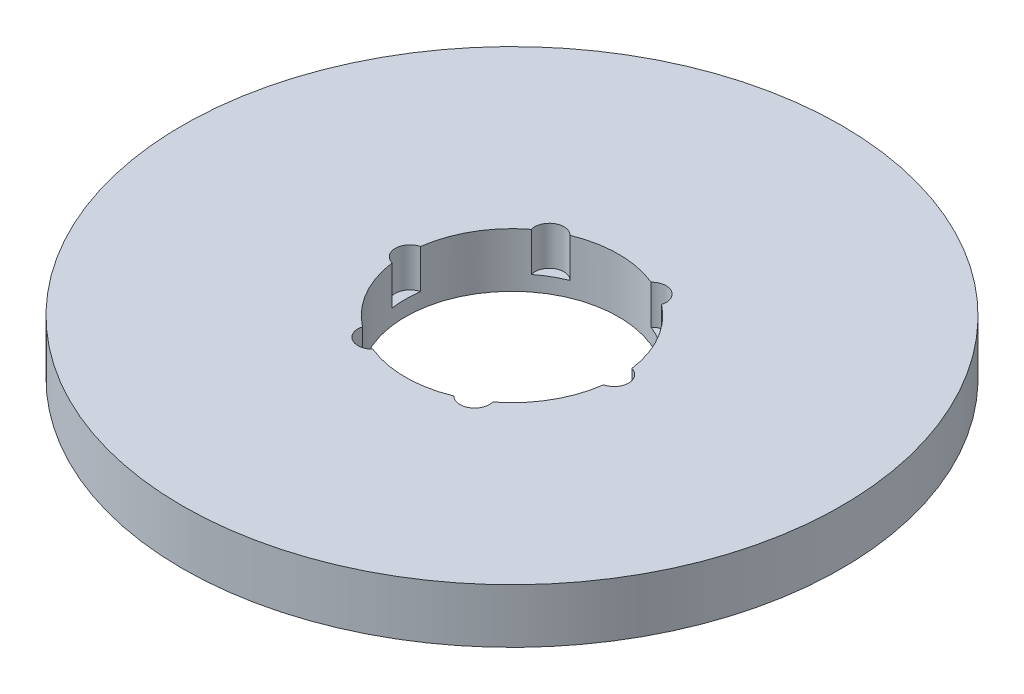
ISO-10303-21;
HEADER;
FILE_DESCRIPTION(('STEP AP214'),'2;1');
FILE_NAME('part.step','',(''),(''),'','','');
FILE_SCHEMA(('AUTOMOTIVE_DESIGN { 1 0 10303 214 1 1 1 1 }'));
ENDSEC;
DATA;
#1=APPLICATION_CONTEXT('core data for automotive mechanical design processes');
#2=APPLICATION_PROTOCOL_DEFINITION('international standard','automotive_design',2000,#1);
#3=PRODUCT_CONTEXT('',#1,'mechanical');
#4=PRODUCT('Part','Part','',(#3));
#5=PRODUCT_RELATED_PRODUCT_CATEGORY('part','',(#4));
#6=PRODUCT_DEFINITION_FORMATION('','',#4);
#7=PRODUCT_DEFINITION_CONTEXT('part definition',#1,'design');
#8=PRODUCT_DEFINITION('design','',#6,#7);
#9=PRODUCT_DEFINITION_SHAPE('','',#8);
#10=(LENGTH_UNIT() NAMED_UNIT(*) SI_UNIT(.MILLI.,.METRE.));
#11=(NAMED_UNIT(*) PLANE_ANGLE_UNIT() SI_UNIT($,.RADIAN.));
#12=(NAMED_UNIT(*) SI_UNIT($,.STERADIAN.) SOLID_ANGLE_UNIT());
#13=UNCERTAINTY_MEASURE_WITH_UNIT(LENGTH_MEASURE(1.E-05),#10,'distance_accuracy_value','');
#14=(GEOMETRIC_REPRESENTATION_CONTEXT(3) GLOBAL_UNCERTAINTY_ASSIGNED_CONTEXT((#13)) GLOBAL_UNIT_ASSIGNED_CONTEXT((#10,
#11,#12)) REPRESENTATION_CONTEXT('',''));
#15=CARTESIAN_POINT('',(0.,0.,0.));
#16=DIRECTION('',(0.,0.,1.));
#17=DIRECTION('',(1.,0.,0.));
#18=AXIS2_PLACEMENT_3D('',#15,#16,#17);
#19=CARTESIAN_POINT('',(0.,14.,0.));
#20=DIRECTION('',(0.,-1.,0.));
#21=DIRECTION('',(0.,0.,-1.));
#22=AXIS2_PLACEMENT_3D('',#19,#20,#21);
#23=CYLINDRICAL_SURFACE('',#22,85.);
#24=CARTESIAN_POINT('',(0.,14.,0.));
#25=DIRECTION('',(0.,1.,0.));
#26=DIRECTION('',(0.,0.,1.));
#27=AXIS2_PLACEMENT_3D('',#24,#25,#26);
#28=CIRCLE('',#27,85.);
#29=CARTESIAN_POINT('',(0.,14.,85.));
#30=VERTEX_POINT('',#29);
#31=EDGE_CURVE('E162',#30,#30,#28,.T.);
#32=ORIENTED_EDGE('',*,*,#31,.F.);
#33=EDGE_LOOP('',(#32));
#34=FACE_BOUND('',#33,.T.);
#35=CARTESIAN_POINT('',(0.,0.,0.));
#36=DIRECTION('',(0.,1.,0.));
#37=DIRECTION('',(0.,0.,1.));
#38=AXIS2_PLACEMENT_3D('',#35,#36,#37);
#39=CIRCLE('',#38,85.);
#40=CARTESIAN_POINT('',(0.,0.,85.));
#41=VERTEX_POINT('',#40);
#42=EDGE_CURVE('E157',#41,#41,#39,.T.);
#43=ORIENTED_EDGE('',*,*,#42,.T.);
#44=EDGE_LOOP('',(#43));
#45=FACE_BOUND('',#44,.T.);
#46=ADVANCED_FACE('F39',(#34,#45),#23,.T.);
#47=CARTESIAN_POINT('',(0.,14.,0.));
#48=DIRECTION('',(0.,1.,0.));
#49=DIRECTION('',(0.,0.,1.));
#50=AXIS2_PLACEMENT_3D('',#47,#48,#49);
#51=PLANE('',#50);
#52=CARTESIAN_POINT('',(-13.1623919128525,14.,-22.7979315421936));
#53=DIRECTION('',(0.,1.,0.));
#54=DIRECTION('',(-0.866025403784433,0.,0.50000000000001));
#55=AXIS2_PLACEMENT_3D('',#52,#53,#54);
#56=CIRCLE('',#55,3.771818067436);
#57=CARTESIAN_POINT('',(-10.4626409466375,14.,-25.4319315904582));
#58=VERTEX_POINT('',#57);
#59=CARTESIAN_POINT('',(-16.7933783513265,14.,-21.776878645692));
#60=VERTEX_POINT('',#59);
#61=EDGE_CURVE('E218',#58,#60,#56,.T.);
#62=ORIENTED_EDGE('',*,*,#61,.F.);
#63=CARTESIAN_POINT('',(0.,14.,0.));
#64=DIRECTION('',(0.,1.,0.));
#65=DIRECTION('',(0.,0.,1.));
#66=AXIS2_PLACEMENT_3D('',#63,#64,#65);
#67=CIRCLE('',#66,27.5);
#68=CARTESIAN_POINT('',(10.462640946637,14.,-25.4319315904584));
#69=VERTEX_POINT('',#68);
#70=EDGE_CURVE('E169',#69,#58,#67,.T.);
#71=ORIENTED_EDGE('',*,*,#70,.F.);
#72=CARTESIAN_POINT('',(13.162391912852,14.,-22.7979315421939));
#73=DIRECTION('',(0.,1.,0.));
#74=DIRECTION('',(-0.866025403784443,0.,-0.499999999999992));
#75=AXIS2_PLACEMENT_3D('',#72,#73,#74);
#76=CIRCLE('',#75,3.771818067436);
#77=CARTESIAN_POINT('',(16.7933783513261,14.,-21.7768786456924));
#78=VERTEX_POINT('',#77);
#79=EDGE_CURVE('E285',#78,#69,#76,.T.);
#80=ORIENTED_EDGE('',*,*,#79,.F.);
#81=CARTESIAN_POINT('',(27.2560192979635,14.,-3.65505294476607));
#82=VERTEX_POINT('',#81);
#83=EDGE_CURVE('E174',#82,#78,#67,.T.);
#84=ORIENTED_EDGE('',*,*,#83,.F.);
#85=CARTESIAN_POINT('',(26.3247838257044,14.,0.));
#86=DIRECTION('',(0.,1.,0.));
#87=DIRECTION('',(0.,0.,-1.));
#88=AXIS2_PLACEMENT_3D('',#85,#86,#87);
#89=CIRCLE('',#88,3.771818067436);
#90=CARTESIAN_POINT('',(27.2560192979635,14.,3.65505294476607));
#91=VERTEX_POINT('',#90);
#92=EDGE_CURVE('E280',#91,#82,#89,.T.);
#93=ORIENTED_EDGE('',*,*,#92,.F.);
#94=CARTESIAN_POINT('',(16.7933783513264,14.,21.7768786456921));
#95=VERTEX_POINT('',#94);
#96=EDGE_CURVE('E164',#95,#91,#67,.T.);
#97=ORIENTED_EDGE('',*,*,#96,.F.);
#98=CARTESIAN_POINT('',(13.1623919128523,14.,22.7979315421937));
#99=DIRECTION('',(0.,1.,0.));
#100=DIRECTION('',(0.866025403784436,0.,-0.500000000000004));
#101=AXIS2_PLACEMENT_3D('',#98,#99,#100);
#102=CIRCLE('',#101,3.771818067436);
#103=CARTESIAN_POINT('',(10.4626409466373,14.,25.4319315904583));
#104=VERTEX_POINT('',#103);
#105=EDGE_CURVE('E269',#104,#95,#102,.T.);
#106=ORIENTED_EDGE('',*,*,#105,.F.);
#107=CARTESIAN_POINT('',(-10.4626409466371,14.,25.4319315904583));
#108=VERTEX_POINT('',#107);
#109=EDGE_CURVE('E149',#108,#104,#67,.T.);
#110=ORIENTED_EDGE('',*,*,#109,.F.);
#111=CARTESIAN_POINT('',(-13.1623919128522,14.,22.7979315421938));
#112=DIRECTION('',(0.,1.,0.));
#113=DIRECTION('',(0.86602540378444,0.,0.499999999999998));
#114=AXIS2_PLACEMENT_3D('',#111,#112,#113);
#115=CIRCLE('',#114,3.771818067436);
#116=CARTESIAN_POINT('',(-16.7933783513262,14.,21.7768786456923));
#117=VERTEX_POINT('',#116);
#118=EDGE_CURVE('E128',#117,#108,#115,.T.);
#119=ORIENTED_EDGE('',*,*,#118,.F.);
#120=CARTESIAN_POINT('',(-27.2560192979635,14.,3.65505294476607));
#121=VERTEX_POINT('',#120);
#122=EDGE_CURVE('E148',#121,#117,#67,.T.);
#123=ORIENTED_EDGE('',*,*,#122,.F.);
#124=CARTESIAN_POINT('',(-26.3247838257044,14.,0.));
#125=DIRECTION('',(0.,1.,0.));
#126=DIRECTION('',(0.,0.,1.));
#127=AXIS2_PLACEMENT_3D('',#124,#125,#126);
#128=CIRCLE('',#127,3.771818067436);
#129=CARTESIAN_POINT('',(-27.2560192979635,14.,-3.65505294476607));
#130=VERTEX_POINT('',#129);
#131=EDGE_CURVE('E179',#130,#121,#128,.T.);
#132=ORIENTED_EDGE('',*,*,#131,.F.);
#133=EDGE_CURVE('E161',#60,#130,#67,.T.);
#134=ORIENTED_EDGE('',*,*,#133,.F.);
#135=EDGE_LOOP('',(#62,#71,#80,#84,#93,#97,#106,#110,#119,#123,#132,#134));
#136=FACE_BOUND('',#135,.T.);
#137=ORIENTED_EDGE('',*,*,#31,.T.);
#138=EDGE_LOOP('',(#137));
#139=FACE_BOUND('',#138,.T.);
#140=ADVANCED_FACE('F141',(#136,#139),#51,.T.);
#141=CARTESIAN_POINT('',(0.,0.,0.));
#142=DIRECTION('',(0.,1.,0.));
#143=DIRECTION('',(0.,0.,1.));
#144=AXIS2_PLACEMENT_3D('',#141,#142,#143);
#145=PLANE('',#144);
#146=CARTESIAN_POINT('',(0.,0.,0.));
#147=DIRECTION('',(0.,1.,0.));
#148=DIRECTION('',(0.,0.,1.));
#149=AXIS2_PLACEMENT_3D('',#146,#147,#148);
#150=CIRCLE('',#149,27.5);
#151=CARTESIAN_POINT('',(0.,0.,27.5));
#152=VERTEX_POINT('',#151);
#153=EDGE_CURVE('E166',#152,#152,#150,.T.);
#154=ORIENTED_EDGE('',*,*,#153,.T.);
#155=EDGE_LOOP('',(#154));
#156=FACE_BOUND('',#155,.T.);
#157=ORIENTED_EDGE('',*,*,#42,.F.);
#158=EDGE_LOOP('',(#157));
#159=FACE_BOUND('',#158,.T.);
#160=ADVANCED_FACE('F234',(#156,#159),#145,.F.);
#161=CARTESIAN_POINT('',(0.,14.,0.));
#162=DIRECTION('',(0.,-1.,0.));
#163=DIRECTION('',(0.,0.,-1.));
#164=AXIS2_PLACEMENT_3D('',#161,#162,#163);
#165=CYLINDRICAL_SURFACE('',#164,27.5);
#166=DIRECTION('',(0.,1.,0.));
#167=VECTOR('',#166,1.);
#168=CARTESIAN_POINT('',(-10.4626409466375,8.96417028676177,-25.4319315904582));
#169=LINE('',#168,#167);
#170=CARTESIAN_POINT('',(-10.4626409466375,3.92834057352353,-25.4319315904582));
#171=VERTEX_POINT('',#170);
#172=EDGE_CURVE('E11',#171,#58,#169,.T.);
#173=ORIENTED_EDGE('',*,*,#172,.F.);
#174=CARTESIAN_POINT('',(0.,3.92834057352353,0.));
#175=DIRECTION('',(0.,1.,0.));
#176=DIRECTION('',(0.,0.,1.));
#177=AXIS2_PLACEMENT_3D('',#174,#175,#176);
#178=CIRCLE('',#177,27.5);
#179=CARTESIAN_POINT('',(-16.7933783513265,3.92834057352353,-21.776878645692));
#180=VERTEX_POINT('',#179);
#181=EDGE_CURVE('E214',#171,#180,#178,.T.);
#182=ORIENTED_EDGE('',*,*,#181,.T.);
#183=DIRECTION('',(0.,1.,0.));
#184=VECTOR('',#183,1.);
#185=CARTESIAN_POINT('',(-16.7933783513265,8.96417028676177,-21.776878645692));
#186=LINE('',#185,#184);
#187=EDGE_CURVE('E46',#60,#180,#186,.F.);
#188=ORIENTED_EDGE('',*,*,#187,.F.);
#189=ORIENTED_EDGE('',*,*,#133,.T.);
#190=DIRECTION('',(0.,1.,0.));
#191=VECTOR('',#190,1.);
#192=CARTESIAN_POINT('',(-27.2560192979635,8.96417028676177,-3.65505294476607));
#193=LINE('',#192,#191);
#194=CARTESIAN_POINT('',(-27.2560192979635,3.92834057352353,-3.65505294476607));
#195=VERTEX_POINT('',#194);
#196=EDGE_CURVE('E187',#195,#130,#193,.T.);
#197=ORIENTED_EDGE('',*,*,#196,.F.);
#198=CARTESIAN_POINT('',(0.,3.92834057352353,0.));
#199=DIRECTION('',(0.,1.,0.));
#200=DIRECTION('',(0.,0.,1.));
#201=AXIS2_PLACEMENT_3D('',#198,#199,#200);
#202=CIRCLE('',#201,27.5);
#203=CARTESIAN_POINT('',(-27.2560192979635,3.92834057352353,3.65505294476607));
#204=VERTEX_POINT('',#203);
#205=EDGE_CURVE('E184',#195,#204,#202,.T.);
#206=ORIENTED_EDGE('',*,*,#205,.T.);
#207=DIRECTION('',(0.,1.,0.));
#208=VECTOR('',#207,1.);
#209=CARTESIAN_POINT('',(-27.2560192979635,8.96417028676177,3.65505294476607));
#210=LINE('',#209,#208);
#211=EDGE_CURVE('E158',#121,#204,#210,.F.);
#212=ORIENTED_EDGE('',*,*,#211,.F.);
#213=ORIENTED_EDGE('',*,*,#122,.T.);
#214=DIRECTION('',(0.,1.,0.));
#215=VECTOR('',#214,1.);
#216=CARTESIAN_POINT('',(-16.7933783513262,8.96417028676177,21.7768786456923));
#217=LINE('',#216,#215);
#218=CARTESIAN_POINT('',(-16.7933783513262,3.92834057352353,21.7768786456923));
#219=VERTEX_POINT('',#218);
#220=EDGE_CURVE('E127',#219,#117,#217,.T.);
#221=ORIENTED_EDGE('',*,*,#220,.F.);
#222=CARTESIAN_POINT('',(0.,3.92834057352353,0.));
#223=DIRECTION('',(0.,1.,0.));
#224=DIRECTION('',(0.,0.,1.));
#225=AXIS2_PLACEMENT_3D('',#222,#223,#224);
#226=CIRCLE('',#225,27.5);
#227=CARTESIAN_POINT('',(-10.4626409466371,3.92834057352353,25.4319315904583));
#228=VERTEX_POINT('',#227);
#229=EDGE_CURVE('E189',#219,#228,#226,.T.);
#230=ORIENTED_EDGE('',*,*,#229,.T.);
#231=DIRECTION('',(0.,1.,0.));
#232=VECTOR('',#231,1.);
#233=CARTESIAN_POINT('',(-10.4626409466371,8.96417028676177,25.4319315904583));
#234=LINE('',#233,#232);
#235=EDGE_CURVE('E140',#108,#228,#234,.F.);
#236=ORIENTED_EDGE('',*,*,#235,.F.);
#237=ORIENTED_EDGE('',*,*,#109,.T.);
#238=DIRECTION('',(0.,1.,0.));
#239=VECTOR('',#238,1.);
#240=CARTESIAN_POINT('',(10.4626409466373,8.96417028676177,25.4319315904583));
#241=LINE('',#240,#239);
#242=CARTESIAN_POINT('',(10.4626409466373,3.92834057352353,25.4319315904583));
#243=VERTEX_POINT('',#242);
#244=EDGE_CURVE('E196',#243,#104,#241,.T.);
#245=ORIENTED_EDGE('',*,*,#244,.F.);
#246=CARTESIAN_POINT('',(0.,3.92834057352353,0.));
#247=DIRECTION('',(0.,1.,0.));
#248=DIRECTION('',(0.,0.,1.));
#249=AXIS2_PLACEMENT_3D('',#246,#247,#248);
#250=CIRCLE('',#249,27.5);
#251=CARTESIAN_POINT('',(16.7933783513264,3.92834057352353,21.7768786456921));
#252=VERTEX_POINT('',#251);
#253=EDGE_CURVE('E136',#243,#252,#250,.T.);
#254=ORIENTED_EDGE('',*,*,#253,.T.);
#255=DIRECTION('',(0.,1.,0.));
#256=VECTOR('',#255,1.);
#257=CARTESIAN_POINT('',(16.7933783513264,8.96417028676177,21.7768786456921));
#258=LINE('',#257,#256);
#259=EDGE_CURVE('E194',#95,#252,#258,.F.);
#260=ORIENTED_EDGE('',*,*,#259,.F.);
#261=ORIENTED_EDGE('',*,*,#96,.T.);
#262=DIRECTION('',(0.,1.,0.));
#263=VECTOR('',#262,1.);
#264=CARTESIAN_POINT('',(27.2560192979635,8.96417028676177,3.65505294476607));
#265=LINE('',#264,#263);
#266=CARTESIAN_POINT('',(27.2560192979635,3.92834057352353,3.65505294476607));
#267=VERTEX_POINT('',#266);
#268=EDGE_CURVE('E206',#267,#91,#265,.T.);
#269=ORIENTED_EDGE('',*,*,#268,.F.);
#270=CARTESIAN_POINT('',(0.,3.92834057352353,0.));
#271=DIRECTION('',(0.,1.,0.));
#272=DIRECTION('',(0.,0.,1.));
#273=AXIS2_PLACEMENT_3D('',#270,#271,#272);
#274=CIRCLE('',#273,27.5);
#275=CARTESIAN_POINT('',(27.2560192979635,3.92834057352353,-3.65505294476607));
#276=VERTEX_POINT('',#275);
#277=EDGE_CURVE('E199',#267,#276,#274,.T.);
#278=ORIENTED_EDGE('',*,*,#277,.T.);
#279=DIRECTION('',(0.,1.,0.));
#280=VECTOR('',#279,1.);
#281=CARTESIAN_POINT('',(27.2560192979635,8.96417028676177,-3.65505294476607));
#282=LINE('',#281,#280);
#283=EDGE_CURVE('E201',#82,#276,#282,.F.);
#284=ORIENTED_EDGE('',*,*,#283,.F.);
#285=ORIENTED_EDGE('',*,*,#83,.T.);
#286=DIRECTION('',(0.,1.,0.));
#287=VECTOR('',#286,1.);
#288=CARTESIAN_POINT('',(16.7933783513261,8.96417028676177,-21.7768786456924));
#289=LINE('',#288,#287);
#290=CARTESIAN_POINT('',(16.7933783513261,3.92834057352353,-21.7768786456924));
#291=VERTEX_POINT('',#290);
#292=EDGE_CURVE('E213',#291,#78,#289,.T.);
#293=ORIENTED_EDGE('',*,*,#292,.F.);
#294=CARTESIAN_POINT('',(0.,3.92834057352353,0.));
#295=DIRECTION('',(0.,1.,0.));
#296=DIRECTION('',(0.,0.,1.));
#297=AXIS2_PLACEMENT_3D('',#294,#295,#296);
#298=CIRCLE('',#297,27.5);
#299=CARTESIAN_POINT('',(10.462640946637,3.92834057352353,-25.4319315904584));
#300=VERTEX_POINT('',#299);
#301=EDGE_CURVE('E208',#291,#300,#298,.T.);
#302=ORIENTED_EDGE('',*,*,#301,.T.);
#303=DIRECTION('',(0.,1.,0.));
#304=VECTOR('',#303,1.);
#305=CARTESIAN_POINT('',(10.462640946637,8.96417028676177,-25.4319315904584));
#306=LINE('',#305,#304);
#307=EDGE_CURVE('E211',#69,#300,#306,.F.);
#308=ORIENTED_EDGE('',*,*,#307,.F.);
#309=ORIENTED_EDGE('',*,*,#70,.T.);
#310=EDGE_LOOP('',(#173,#182,#188,#189,#197,#206,#212,#213,#221,#230,#236,#237,#245,#254,#260,
#261,#269,#278,#284,#285,#293,#302,#308,#309));
#311=FACE_BOUND('',#310,.T.);
#312=ORIENTED_EDGE('',*,*,#153,.F.);
#313=EDGE_LOOP('',(#312));
#314=FACE_BOUND('',#313,.T.);
#315=ADVANCED_FACE('F152',(#311,#314),#165,.F.);
#316=CARTESIAN_POINT('',(-26.3247838257044,3.92834057352353,0.));
#317=DIRECTION('',(0.,1.,0.));
#318=DIRECTION('',(0.,0.,1.));
#319=AXIS2_PLACEMENT_3D('',#316,#317,#318);
#320=CYLINDRICAL_SURFACE('',#319,3.771818067436);
#321=ORIENTED_EDGE('',*,*,#196,.T.);
#322=ORIENTED_EDGE('',*,*,#131,.T.);
#323=ORIENTED_EDGE('',*,*,#211,.T.);
#324=CARTESIAN_POINT('',(-26.3247838257044,3.92834057352353,0.));
#325=DIRECTION('',(0.,1.,0.));
#326=DIRECTION('',(0.,0.,1.));
#327=AXIS2_PLACEMENT_3D('',#324,#325,#326);
#328=CIRCLE('',#327,3.771818067436);
#329=EDGE_CURVE('E180',#195,#204,#328,.T.);
#330=ORIENTED_EDGE('',*,*,#329,.F.);
#331=EDGE_LOOP('',(#321,#322,#323,#330));
#332=FACE_BOUND('',#331,.T.);
#333=ADVANCED_FACE('F244',(#332),#320,.F.);
#334=CARTESIAN_POINT('',(-26.3247838257044,3.92834057352353,0.));
#335=DIRECTION('',(0.,1.,0.));
#336=DIRECTION('',(0.,0.,1.));
#337=AXIS2_PLACEMENT_3D('',#334,#335,#336);
#338=PLANE('',#337);
#339=ORIENTED_EDGE('',*,*,#329,.T.);
#340=ORIENTED_EDGE('',*,*,#205,.F.);
#341=EDGE_LOOP('',(#339,#340));
#342=FACE_BOUND('',#341,.T.);
#343=ADVANCED_FACE('F248',(#342),#338,.T.);
#344=CARTESIAN_POINT('',(-13.1623919128522,3.92834057352353,22.7979315421938));
#345=DIRECTION('',(0.,1.,0.));
#346=DIRECTION('',(0.,0.,1.));
#347=AXIS2_PLACEMENT_3D('',#344,#345,#346);
#348=CYLINDRICAL_SURFACE('',#347,3.771818067436);
#349=ORIENTED_EDGE('',*,*,#220,.T.);
#350=ORIENTED_EDGE('',*,*,#118,.T.);
#351=ORIENTED_EDGE('',*,*,#235,.T.);
#352=CARTESIAN_POINT('',(-13.1623919128522,3.92834057352353,22.7979315421938));
#353=DIRECTION('',(0.,1.,0.));
#354=DIRECTION('',(0.86602540378444,0.,0.499999999999998));
#355=AXIS2_PLACEMENT_3D('',#352,#353,#354);
#356=CIRCLE('',#355,3.771818067436);
#357=EDGE_CURVE('E135',#219,#228,#356,.T.);
#358=ORIENTED_EDGE('',*,*,#357,.F.);
#359=EDGE_LOOP('',(#349,#350,#351,#358));
#360=FACE_BOUND('',#359,.T.);
#361=ADVANCED_FACE('F126',(#360),#348,.F.);
#362=CARTESIAN_POINT('',(-13.1623919128522,3.92834057352353,22.7979315421938));
#363=DIRECTION('',(0.,1.,0.));
#364=DIRECTION('',(0.86602540378444,0.,0.499999999999998));
#365=AXIS2_PLACEMENT_3D('',#362,#363,#364);
#366=PLANE('',#365);
#367=ORIENTED_EDGE('',*,*,#357,.T.);
#368=ORIENTED_EDGE('',*,*,#229,.F.);
#369=EDGE_LOOP('',(#367,#368));
#370=FACE_BOUND('',#369,.T.);
#371=ADVANCED_FACE('F258',(#370),#366,.T.);
#372=CARTESIAN_POINT('',(13.1623919128523,3.92834057352353,22.7979315421937));
#373=DIRECTION('',(0.,1.,0.));
#374=DIRECTION('',(0.,0.,1.));
#375=AXIS2_PLACEMENT_3D('',#372,#373,#374);
#376=CYLINDRICAL_SURFACE('',#375,3.771818067436);
#377=ORIENTED_EDGE('',*,*,#244,.T.);
#378=ORIENTED_EDGE('',*,*,#105,.T.);
#379=ORIENTED_EDGE('',*,*,#259,.T.);
#380=CARTESIAN_POINT('',(13.1623919128523,3.92834057352353,22.7979315421937));
#381=DIRECTION('',(0.,1.,0.));
#382=DIRECTION('',(0.866025403784436,0.,-0.500000000000004));
#383=AXIS2_PLACEMENT_3D('',#380,#381,#382);
#384=CIRCLE('',#383,3.771818067436);
#385=EDGE_CURVE('E147',#243,#252,#384,.T.);
#386=ORIENTED_EDGE('',*,*,#385,.F.);
#387=EDGE_LOOP('',(#377,#378,#379,#386));
#388=FACE_BOUND('',#387,.T.);
#389=ADVANCED_FACE('F256',(#388),#376,.F.);
#390=CARTESIAN_POINT('',(13.1623919128523,3.92834057352353,22.7979315421937));
#391=DIRECTION('',(0.,1.,0.));
#392=DIRECTION('',(0.866025403784436,0.,-0.500000000000004));
#393=AXIS2_PLACEMENT_3D('',#390,#391,#392);
#394=PLANE('',#393);
#395=ORIENTED_EDGE('',*,*,#385,.T.);
#396=ORIENTED_EDGE('',*,*,#253,.F.);
#397=EDGE_LOOP('',(#395,#396));
#398=FACE_BOUND('',#397,.T.);
#399=ADVANCED_FACE('F263',(#398),#394,.T.);
#400=CARTESIAN_POINT('',(26.3247838257044,3.92834057352353,0.));
#401=DIRECTION('',(0.,1.,0.));
#402=DIRECTION('',(0.,0.,1.));
#403=AXIS2_PLACEMENT_3D('',#400,#401,#402);
#404=CYLINDRICAL_SURFACE('',#403,3.771818067436);
#405=ORIENTED_EDGE('',*,*,#268,.T.);
#406=ORIENTED_EDGE('',*,*,#92,.T.);
#407=ORIENTED_EDGE('',*,*,#283,.T.);
#408=CARTESIAN_POINT('',(26.3247838257044,3.92834057352353,0.));
#409=DIRECTION('',(0.,1.,0.));
#410=DIRECTION('',(0.,0.,-1.));
#411=AXIS2_PLACEMENT_3D('',#408,#409,#410);
#412=CIRCLE('',#411,3.771818067436);
#413=EDGE_CURVE('E273',#267,#276,#412,.T.);
#414=ORIENTED_EDGE('',*,*,#413,.F.);
#415=EDGE_LOOP('',(#405,#406,#407,#414));
#416=FACE_BOUND('',#415,.T.);
#417=ADVANCED_FACE('F297',(#416),#404,.F.);
#418=CARTESIAN_POINT('',(26.3247838257044,3.92834057352353,0.));
#419=DIRECTION('',(0.,1.,0.));
#420=DIRECTION('',(0.,0.,-1.));
#421=AXIS2_PLACEMENT_3D('',#418,#419,#420);
#422=PLANE('',#421);
#423=ORIENTED_EDGE('',*,*,#413,.T.);
#424=ORIENTED_EDGE('',*,*,#277,.F.);
#425=EDGE_LOOP('',(#423,#424));
#426=FACE_BOUND('',#425,.T.);
#427=ADVANCED_FACE('F299',(#426),#422,.T.);
#428=CARTESIAN_POINT('',(13.162391912852,3.92834057352353,-22.7979315421939));
#429=DIRECTION('',(0.,1.,0.));
#430=DIRECTION('',(0.,0.,1.));
#431=AXIS2_PLACEMENT_3D('',#428,#429,#430);
#432=CYLINDRICAL_SURFACE('',#431,3.771818067436);
#433=ORIENTED_EDGE('',*,*,#292,.T.);
#434=ORIENTED_EDGE('',*,*,#79,.T.);
#435=ORIENTED_EDGE('',*,*,#307,.T.);
#436=CARTESIAN_POINT('',(13.162391912852,3.92834057352353,-22.7979315421939));
#437=DIRECTION('',(0.,1.,0.));
#438=DIRECTION('',(-0.866025403784443,0.,-0.499999999999992));
#439=AXIS2_PLACEMENT_3D('',#436,#437,#438);
#440=CIRCLE('',#439,3.771818067436);
#441=EDGE_CURVE('E56',#291,#300,#440,.T.);
#442=ORIENTED_EDGE('',*,*,#441,.F.);
#443=EDGE_LOOP('',(#433,#434,#435,#442));
#444=FACE_BOUND('',#443,.T.);
#445=ADVANCED_FACE('F292',(#444),#432,.F.);
#446=CARTESIAN_POINT('',(13.162391912852,3.92834057352353,-22.7979315421939));
#447=DIRECTION('',(0.,1.,0.));
#448=DIRECTION('',(-0.866025403784443,0.,-0.499999999999992));
#449=AXIS2_PLACEMENT_3D('',#446,#447,#448);
#450=PLANE('',#449);
#451=ORIENTED_EDGE('',*,*,#441,.T.);
#452=ORIENTED_EDGE('',*,*,#301,.F.);
#453=EDGE_LOOP('',(#451,#452));
#454=FACE_BOUND('',#453,.T.);
#455=ADVANCED_FACE('F226',(#454),#450,.T.);
#456=CARTESIAN_POINT('',(-13.1623919128525,3.92834057352353,-22.7979315421936));
#457=DIRECTION('',(0.,1.,0.));
#458=DIRECTION('',(0.,0.,1.));
#459=AXIS2_PLACEMENT_3D('',#456,#457,#458);
#460=CYLINDRICAL_SURFACE('',#459,3.771818067436);
#461=ORIENTED_EDGE('',*,*,#172,.T.);
#462=ORIENTED_EDGE('',*,*,#61,.T.);
#463=ORIENTED_EDGE('',*,*,#187,.T.);
#464=CARTESIAN_POINT('',(-13.1623919128525,3.92834057352353,-22.7979315421936));
#465=DIRECTION('',(0.,1.,0.));
#466=DIRECTION('',(-0.866025403784433,0.,0.50000000000001));
#467=AXIS2_PLACEMENT_3D('',#464,#465,#466);
#468=CIRCLE('',#467,3.771818067436);
#469=EDGE_CURVE('E55',#171,#180,#468,.T.);
#470=ORIENTED_EDGE('',*,*,#469,.F.);
#471=EDGE_LOOP('',(#461,#462,#463,#470));
#472=FACE_BOUND('',#471,.T.);
#473=ADVANCED_FACE('F217',(#472),#460,.F.);
#474=CARTESIAN_POINT('',(-13.1623919128525,3.92834057352353,-22.7979315421936));
#475=DIRECTION('',(0.,1.,0.));
#476=DIRECTION('',(-0.866025403784433,0.,0.50000000000001));
#477=AXIS2_PLACEMENT_3D('',#474,#475,#476);
#478=PLANE('',#477);
#479=ORIENTED_EDGE('',*,*,#469,.T.);
#480=ORIENTED_EDGE('',*,*,#181,.F.);
#481=EDGE_LOOP('',(#479,#480));
#482=FACE_BOUND('',#481,.T.);
#483=ADVANCED_FACE('F219',(#482),#478,.T.);
#484=CLOSED_SHELL('',(#46,#140,#160,#315,#333,#343,#361,#371,#389,#399,#417,#427,#445,#455,#473,#483));
#485=MANIFOLD_SOLID_BREP('B2',#484);
#486=ADVANCED_BREP_SHAPE_REPRESENTATION('',(#18,#485),#14);
#487=SHAPE_DEFINITION_REPRESENTATION(#9,#486);
ENDSEC;
END-ISO-10303-21;
